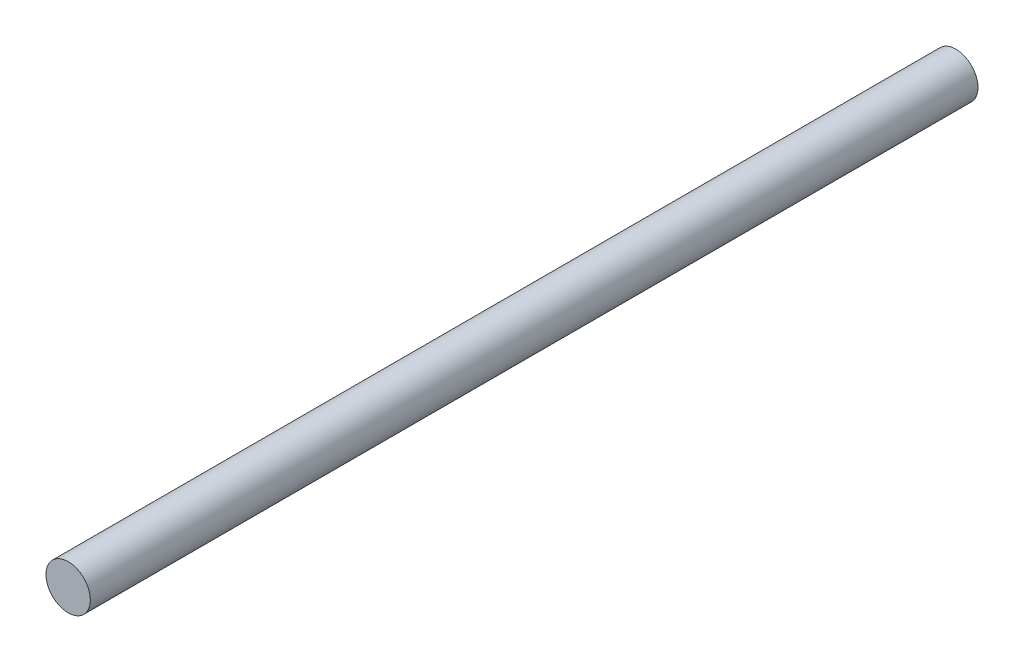
ISO-10303-21;
HEADER;
FILE_DESCRIPTION(('STEP AP214'),'2;1');
FILE_NAME('part.step','',(''),(''),'','','');
FILE_SCHEMA(('AUTOMOTIVE_DESIGN { 1 0 10303 214 1 1 1 1 }'));
ENDSEC;
DATA;
#1=APPLICATION_CONTEXT('core data for automotive mechanical design processes');
#2=APPLICATION_PROTOCOL_DEFINITION('international standard','automotive_design',2000,#1);
#3=PRODUCT_CONTEXT('',#1,'mechanical');
#4=PRODUCT('Part','Part','',(#3));
#5=PRODUCT_RELATED_PRODUCT_CATEGORY('part','',(#4));
#6=PRODUCT_DEFINITION_FORMATION('','',#4);
#7=PRODUCT_DEFINITION_CONTEXT('part definition',#1,'design');
#8=PRODUCT_DEFINITION('design','',#6,#7);
#9=PRODUCT_DEFINITION_SHAPE('','',#8);
#10=(LENGTH_UNIT() NAMED_UNIT(*) SI_UNIT(.MILLI.,.METRE.));
#11=(NAMED_UNIT(*) PLANE_ANGLE_UNIT() SI_UNIT($,.RADIAN.));
#12=(NAMED_UNIT(*) SI_UNIT($,.STERADIAN.) SOLID_ANGLE_UNIT());
#13=UNCERTAINTY_MEASURE_WITH_UNIT(LENGTH_MEASURE(1.E-05),#10,'distance_accuracy_value','');
#14=(GEOMETRIC_REPRESENTATION_CONTEXT(3) GLOBAL_UNCERTAINTY_ASSIGNED_CONTEXT((#13)) GLOBAL_UNIT_ASSIGNED_CONTEXT((#10,
#11,#12)) REPRESENTATION_CONTEXT('',''));
#15=CARTESIAN_POINT('',(0.,0.,0.));
#16=DIRECTION('',(0.,0.,1.));
#17=DIRECTION('',(1.,0.,0.));
#18=AXIS2_PLACEMENT_3D('',#15,#16,#17);
#19=CARTESIAN_POINT('',(0.,0.,20.));
#20=DIRECTION('',(0.,0.,-1.));
#21=DIRECTION('',(-1.,0.,0.));
#22=AXIS2_PLACEMENT_3D('',#19,#20,#21);
#23=CYLINDRICAL_SURFACE('',#22,0.5);
#24=CARTESIAN_POINT('',(0.,0.,20.));
#25=DIRECTION('',(0.,0.,1.));
#26=DIRECTION('',(1.,0.,0.));
#27=AXIS2_PLACEMENT_3D('',#24,#25,#26);
#28=CIRCLE('',#27,0.5);
#29=CARTESIAN_POINT('',(0.5,0.,20.));
#30=VERTEX_POINT('',#29);
#31=EDGE_CURVE('E10',#30,#30,#28,.T.);
#32=ORIENTED_EDGE('',*,*,#31,.F.);
#33=EDGE_LOOP('',(#32));
#34=FACE_BOUND('',#33,.T.);
#35=CARTESIAN_POINT('',(0.,0.,0.));
#36=DIRECTION('',(0.,0.,1.));
#37=DIRECTION('',(1.,0.,0.));
#38=AXIS2_PLACEMENT_3D('',#35,#36,#37);
#39=CIRCLE('',#38,0.5);
#40=CARTESIAN_POINT('',(0.5,0.,0.));
#41=VERTEX_POINT('',#40);
#42=EDGE_CURVE('E34',#41,#41,#39,.T.);
#43=ORIENTED_EDGE('',*,*,#42,.T.);
#44=EDGE_LOOP('',(#43));
#45=FACE_BOUND('',#44,.T.);
#46=ADVANCED_FACE('F31',(#34,#45),#23,.T.);
#47=CARTESIAN_POINT('',(0.,0.,20.));
#48=DIRECTION('',(0.,0.,1.));
#49=DIRECTION('',(1.,0.,0.));
#50=AXIS2_PLACEMENT_3D('',#47,#48,#49);
#51=PLANE('',#50);
#52=ORIENTED_EDGE('',*,*,#31,.T.);
#53=EDGE_LOOP('',(#52));
#54=FACE_BOUND('',#53,.T.);
#55=ADVANCED_FACE('F46',(#54),#51,.T.);
#56=CARTESIAN_POINT('',(0.,0.,0.));
#57=DIRECTION('',(0.,0.,1.));
#58=DIRECTION('',(1.,0.,0.));
#59=AXIS2_PLACEMENT_3D('',#56,#57,#58);
#60=PLANE('',#59);
#61=ORIENTED_EDGE('',*,*,#42,.F.);
#62=EDGE_LOOP('',(#61));
#63=FACE_BOUND('',#62,.T.);
#64=ADVANCED_FACE('F44',(#63),#60,.F.);
#65=CLOSED_SHELL('',(#46,#55,#64));
#66=MANIFOLD_SOLID_BREP('B2',#65);
#67=ADVANCED_BREP_SHAPE_REPRESENTATION('',(#18,#66),#14);
#68=SHAPE_DEFINITION_REPRESENTATION(#9,#67);
ENDSEC;
END-ISO-10303-21;
